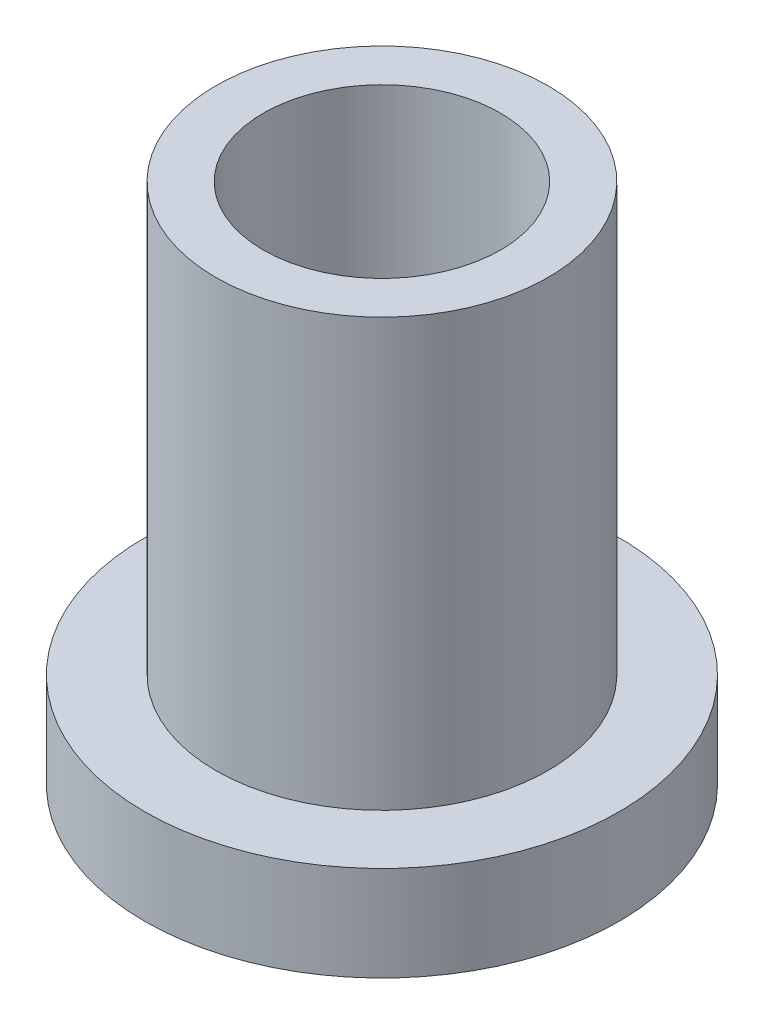
ISO-10303-21;
HEADER;
FILE_DESCRIPTION(('STEP AP214'),'2;1');
FILE_NAME('part.step','',(''),(''),'','','');
FILE_SCHEMA(('AUTOMOTIVE_DESIGN { 1 0 10303 214 1 1 1 1 }'));
ENDSEC;
DATA;
#1=APPLICATION_CONTEXT('core data for automotive mechanical design processes');
#2=APPLICATION_PROTOCOL_DEFINITION('international standard','automotive_design',2000,#1);
#3=PRODUCT_CONTEXT('',#1,'mechanical');
#4=PRODUCT('Part','Part','',(#3));
#5=PRODUCT_RELATED_PRODUCT_CATEGORY('part','',(#4));
#6=PRODUCT_DEFINITION_FORMATION('','',#4);
#7=PRODUCT_DEFINITION_CONTEXT('part definition',#1,'design');
#8=PRODUCT_DEFINITION('design','',#6,#7);
#9=PRODUCT_DEFINITION_SHAPE('','',#8);
#10=(LENGTH_UNIT() NAMED_UNIT(*) SI_UNIT(.MILLI.,.METRE.));
#11=(NAMED_UNIT(*) PLANE_ANGLE_UNIT() SI_UNIT($,.RADIAN.));
#12=(NAMED_UNIT(*) SI_UNIT($,.STERADIAN.) SOLID_ANGLE_UNIT());
#13=UNCERTAINTY_MEASURE_WITH_UNIT(LENGTH_MEASURE(1.E-05),#10,'distance_accuracy_value','');
#14=(GEOMETRIC_REPRESENTATION_CONTEXT(3) GLOBAL_UNCERTAINTY_ASSIGNED_CONTEXT((#13)) GLOBAL_UNIT_ASSIGNED_CONTEXT((#10,
#11,#12)) REPRESENTATION_CONTEXT('',''));
#15=CARTESIAN_POINT('',(0.,0.,0.));
#16=DIRECTION('',(0.,0.,1.));
#17=DIRECTION('',(1.,0.,0.));
#18=AXIS2_PLACEMENT_3D('',#15,#16,#17);
#19=CARTESIAN_POINT('',(0.,2.,0.));
#20=DIRECTION('',(0.,-1.,0.));
#21=DIRECTION('',(0.,0.,-1.));
#22=AXIS2_PLACEMENT_3D('',#19,#20,#21);
#23=CYLINDRICAL_SURFACE('',#22,5.);
#24=CARTESIAN_POINT('',(0.,2.,0.));
#25=DIRECTION('',(0.,1.,0.));
#26=DIRECTION('',(0.,0.,1.));
#27=AXIS2_PLACEMENT_3D('',#24,#25,#26);
#28=CIRCLE('',#27,5.);
#29=CARTESIAN_POINT('',(0.,2.,5.));
#30=VERTEX_POINT('',#29);
#31=EDGE_CURVE('E38',#30,#30,#28,.T.);
#32=ORIENTED_EDGE('',*,*,#31,.F.);
#33=EDGE_LOOP('',(#32));
#34=FACE_BOUND('',#33,.T.);
#35=CARTESIAN_POINT('',(0.,0.,0.));
#36=DIRECTION('',(0.,1.,0.));
#37=DIRECTION('',(0.,0.,1.));
#38=AXIS2_PLACEMENT_3D('',#35,#36,#37);
#39=CIRCLE('',#38,5.);
#40=CARTESIAN_POINT('',(0.,0.,5.));
#41=VERTEX_POINT('',#40);
#42=EDGE_CURVE('E34',#41,#41,#39,.T.);
#43=ORIENTED_EDGE('',*,*,#42,.T.);
#44=EDGE_LOOP('',(#43));
#45=FACE_BOUND('',#44,.T.);
#46=ADVANCED_FACE('F31',(#34,#45),#23,.T.);
#47=CARTESIAN_POINT('',(0.,2.,0.));
#48=DIRECTION('',(0.,1.,0.));
#49=DIRECTION('',(0.,0.,1.));
#50=AXIS2_PLACEMENT_3D('',#47,#48,#49);
#51=PLANE('',#50);
#52=CARTESIAN_POINT('',(0.,2.,0.));
#53=DIRECTION('',(0.,1.,0.));
#54=DIRECTION('',(0.,0.,1.));
#55=AXIS2_PLACEMENT_3D('',#52,#53,#54);
#56=CIRCLE('',#55,3.5);
#57=CARTESIAN_POINT('',(0.,2.,3.5));
#58=VERTEX_POINT('',#57);
#59=EDGE_CURVE('E10',#58,#58,#56,.T.);
#60=ORIENTED_EDGE('',*,*,#59,.F.);
#61=EDGE_LOOP('',(#60));
#62=FACE_BOUND('',#61,.T.);
#63=ORIENTED_EDGE('',*,*,#31,.T.);
#64=EDGE_LOOP('',(#63));
#65=FACE_BOUND('',#64,.T.);
#66=ADVANCED_FACE('F75',(#62,#65),#51,.T.);
#67=CARTESIAN_POINT('',(0.,0.,0.));
#68=DIRECTION('',(0.,1.,0.));
#69=DIRECTION('',(0.,0.,1.));
#70=AXIS2_PLACEMENT_3D('',#67,#68,#69);
#71=PLANE('',#70);
#72=CARTESIAN_POINT('',(0.,0.,0.));
#73=DIRECTION('',(0.,1.,0.));
#74=DIRECTION('',(0.,0.,1.));
#75=AXIS2_PLACEMENT_3D('',#72,#73,#74);
#76=CIRCLE('',#75,2.5);
#77=CARTESIAN_POINT('',(0.,0.,2.5));
#78=VERTEX_POINT('',#77);
#79=EDGE_CURVE('E47',#78,#78,#76,.T.);
#80=ORIENTED_EDGE('',*,*,#79,.T.);
#81=EDGE_LOOP('',(#80));
#82=FACE_BOUND('',#81,.T.);
#83=ORIENTED_EDGE('',*,*,#42,.F.);
#84=EDGE_LOOP('',(#83));
#85=FACE_BOUND('',#84,.T.);
#86=ADVANCED_FACE('F54',(#82,#85),#71,.F.);
#87=CARTESIAN_POINT('',(0.,11.,0.));
#88=DIRECTION('',(0.,-1.,0.));
#89=DIRECTION('',(0.,0.,-1.));
#90=AXIS2_PLACEMENT_3D('',#87,#88,#89);
#91=CYLINDRICAL_SURFACE('',#90,3.5);
#92=CARTESIAN_POINT('',(0.,11.,0.));
#93=DIRECTION('',(0.,1.,0.));
#94=DIRECTION('',(0.,0.,1.));
#95=AXIS2_PLACEMENT_3D('',#92,#93,#94);
#96=CIRCLE('',#95,3.5);
#97=CARTESIAN_POINT('',(0.,11.,3.5));
#98=VERTEX_POINT('',#97);
#99=EDGE_CURVE('E44',#98,#98,#96,.T.);
#100=ORIENTED_EDGE('',*,*,#99,.F.);
#101=EDGE_LOOP('',(#100));
#102=FACE_BOUND('',#101,.T.);
#103=ORIENTED_EDGE('',*,*,#59,.T.);
#104=EDGE_LOOP('',(#103));
#105=FACE_BOUND('',#104,.T.);
#106=ADVANCED_FACE('F66',(#102,#105),#91,.T.);
#107=CARTESIAN_POINT('',(0.,11.,0.));
#108=DIRECTION('',(0.,1.,0.));
#109=DIRECTION('',(0.,0.,1.));
#110=AXIS2_PLACEMENT_3D('',#107,#108,#109);
#111=PLANE('',#110);
#112=CARTESIAN_POINT('',(0.,11.,0.));
#113=DIRECTION('',(0.,1.,0.));
#114=DIRECTION('',(0.,0.,1.));
#115=AXIS2_PLACEMENT_3D('',#112,#113,#114);
#116=CIRCLE('',#115,2.5);
#117=CARTESIAN_POINT('',(0.,11.,2.5));
#118=VERTEX_POINT('',#117);
#119=EDGE_CURVE('E48',#118,#118,#116,.T.);
#120=ORIENTED_EDGE('',*,*,#119,.F.);
#121=EDGE_LOOP('',(#120));
#122=FACE_BOUND('',#121,.T.);
#123=ORIENTED_EDGE('',*,*,#99,.T.);
#124=EDGE_LOOP('',(#123));
#125=FACE_BOUND('',#124,.T.);
#126=ADVANCED_FACE('F60',(#122,#125),#111,.T.);
#127=CARTESIAN_POINT('',(0.,0.,0.));
#128=DIRECTION('',(0.,1.,0.));
#129=DIRECTION('',(0.,0.,1.));
#130=AXIS2_PLACEMENT_3D('',#127,#128,#129);
#131=CYLINDRICAL_SURFACE('',#130,2.5);
#132=ORIENTED_EDGE('',*,*,#79,.F.);
#133=EDGE_LOOP('',(#132));
#134=FACE_BOUND('',#133,.T.);
#135=ORIENTED_EDGE('',*,*,#119,.T.);
#136=EDGE_LOOP('',(#135));
#137=FACE_BOUND('',#136,.T.);
#138=ADVANCED_FACE('F57',(#134,#137),#131,.F.);
#139=CLOSED_SHELL('',(#46,#66,#86,#106,#126,#138));
#140=MANIFOLD_SOLID_BREP('B2',#139);
#141=ADVANCED_BREP_SHAPE_REPRESENTATION('',(#18,#140),#14);
#142=SHAPE_DEFINITION_REPRESENTATION(#9,#141);
ENDSEC;
END-ISO-10303-21;
